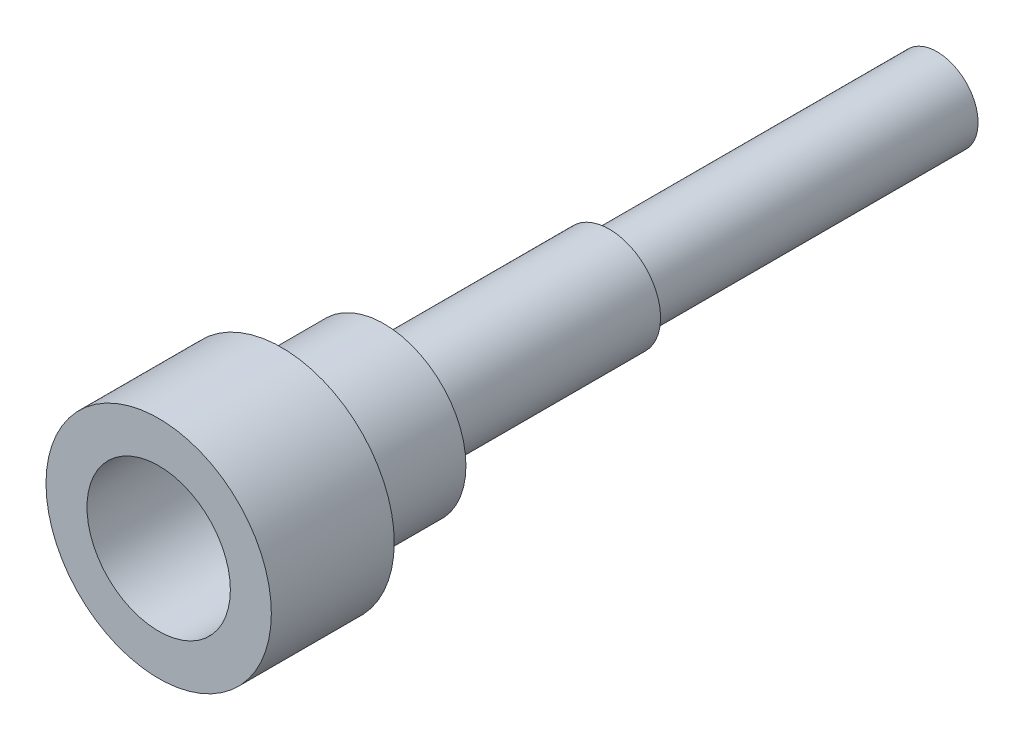
ISO-10303-21;
HEADER;
FILE_DESCRIPTION(('STEP AP214'),'2;1');
FILE_NAME('part.step','',(''),(''),'','','');
FILE_SCHEMA(('AUTOMOTIVE_DESIGN { 1 0 10303 214 1 1 1 1 }'));
ENDSEC;
DATA;
#1=APPLICATION_CONTEXT('core data for automotive mechanical design processes');
#2=APPLICATION_PROTOCOL_DEFINITION('international standard','automotive_design',2000,#1);
#3=PRODUCT_CONTEXT('',#1,'mechanical');
#4=PRODUCT('Part','Part','',(#3));
#5=PRODUCT_RELATED_PRODUCT_CATEGORY('part','',(#4));
#6=PRODUCT_DEFINITION_FORMATION('','',#4);
#7=PRODUCT_DEFINITION_CONTEXT('part definition',#1,'design');
#8=PRODUCT_DEFINITION('design','',#6,#7);
#9=PRODUCT_DEFINITION_SHAPE('','',#8);
#10=(LENGTH_UNIT() NAMED_UNIT(*) SI_UNIT(.MILLI.,.METRE.));
#11=(NAMED_UNIT(*) PLANE_ANGLE_UNIT() SI_UNIT($,.RADIAN.));
#12=(NAMED_UNIT(*) SI_UNIT($,.STERADIAN.) SOLID_ANGLE_UNIT());
#13=UNCERTAINTY_MEASURE_WITH_UNIT(LENGTH_MEASURE(1.E-05),#10,'distance_accuracy_value','');
#14=(GEOMETRIC_REPRESENTATION_CONTEXT(3) GLOBAL_UNCERTAINTY_ASSIGNED_CONTEXT((#13)) GLOBAL_UNIT_ASSIGNED_CONTEXT((#10,
#11,#12)) REPRESENTATION_CONTEXT('',''));
#15=CARTESIAN_POINT('',(0.,0.,0.));
#16=DIRECTION('',(0.,0.,1.));
#17=DIRECTION('',(1.,0.,0.));
#18=AXIS2_PLACEMENT_3D('',#15,#16,#17);
#19=CARTESIAN_POINT('',(0.,0.,5.));
#20=DIRECTION('',(0.,0.,-1.));
#21=DIRECTION('',(-1.,0.,0.));
#22=AXIS2_PLACEMENT_3D('',#19,#20,#21);
#23=CYLINDRICAL_SURFACE('',#22,4.);
#24=CARTESIAN_POINT('',(0.,0.,5.));
#25=DIRECTION('',(0.,0.,1.));
#26=DIRECTION('',(1.,0.,0.));
#27=AXIS2_PLACEMENT_3D('',#24,#25,#26);
#28=CIRCLE('',#27,4.);
#29=CARTESIAN_POINT('',(4.,0.,5.));
#30=VERTEX_POINT('',#29);
#31=EDGE_CURVE('E70',#30,#30,#28,.T.);
#32=ORIENTED_EDGE('',*,*,#31,.F.);
#33=EDGE_LOOP('',(#32));
#34=FACE_BOUND('',#33,.T.);
#35=CARTESIAN_POINT('',(0.,0.,0.));
#36=DIRECTION('',(0.,0.,1.));
#37=DIRECTION('',(1.,0.,0.));
#38=AXIS2_PLACEMENT_3D('',#35,#36,#37);
#39=CIRCLE('',#38,4.);
#40=CARTESIAN_POINT('',(4.,0.,0.));
#41=VERTEX_POINT('',#40);
#42=EDGE_CURVE('E67',#41,#41,#39,.T.);
#43=ORIENTED_EDGE('',*,*,#42,.T.);
#44=EDGE_LOOP('',(#43));
#45=FACE_BOUND('',#44,.T.);
#46=ADVANCED_FACE('F34',(#34,#45),#23,.T.);
#47=CARTESIAN_POINT('',(0.,0.,0.));
#48=DIRECTION('',(0.,0.,1.));
#49=DIRECTION('',(1.,0.,0.));
#50=AXIS2_PLACEMENT_3D('',#47,#48,#49);
#51=PLANE('',#50);
#52=CARTESIAN_POINT('',(0.,0.,0.));
#53=DIRECTION('',(0.,0.,-1.));
#54=DIRECTION('',(-1.,0.,0.));
#55=AXIS2_PLACEMENT_3D('',#52,#53,#54);
#56=CIRCLE('',#55,2.5);
#57=CARTESIAN_POINT('',(-2.5,0.,0.));
#58=VERTEX_POINT('',#57);
#59=EDGE_CURVE('E46',#58,#58,#56,.T.);
#60=ORIENTED_EDGE('',*,*,#59,.F.);
#61=EDGE_LOOP('',(#60));
#62=FACE_BOUND('',#61,.T.);
#63=ORIENTED_EDGE('',*,*,#42,.F.);
#64=EDGE_LOOP('',(#63));
#65=FACE_BOUND('',#64,.T.);
#66=ADVANCED_FACE('F94',(#62,#65),#51,.F.);
#67=CARTESIAN_POINT('',(0.,0.,11.));
#68=DIRECTION('',(0.,0.,1.));
#69=DIRECTION('',(1.,0.,0.));
#70=AXIS2_PLACEMENT_3D('',#67,#68,#69);
#71=PLANE('',#70);
#72=CARTESIAN_POINT('',(0.,0.,11.));
#73=DIRECTION('',(0.,0.,1.));
#74=DIRECTION('',(1.,0.,0.));
#75=AXIS2_PLACEMENT_3D('',#72,#73,#74);
#76=CIRCLE('',#75,5.5);
#77=CARTESIAN_POINT('',(5.5,0.,11.));
#78=VERTEX_POINT('',#77);
#79=EDGE_CURVE('E64',#78,#78,#76,.T.);
#80=ORIENTED_EDGE('',*,*,#79,.T.);
#81=EDGE_LOOP('',(#80));
#82=FACE_BOUND('',#81,.T.);
#83=CARTESIAN_POINT('',(0.,0.,11.));
#84=DIRECTION('',(0.,0.,1.));
#85=DIRECTION('',(1.,0.,0.));
#86=AXIS2_PLACEMENT_3D('',#83,#84,#85);
#87=CIRCLE('',#86,3.5);
#88=CARTESIAN_POINT('',(3.5,0.,11.));
#89=VERTEX_POINT('',#88);
#90=EDGE_CURVE('E59',#89,#89,#87,.T.);
#91=ORIENTED_EDGE('',*,*,#90,.F.);
#92=EDGE_LOOP('',(#91));
#93=FACE_BOUND('',#92,.T.);
#94=ADVANCED_FACE('F99',(#82,#93),#71,.T.);
#95=CARTESIAN_POINT('',(0.,0.,5.));
#96=DIRECTION('',(0.,0.,1.));
#97=DIRECTION('',(1.,0.,0.));
#98=AXIS2_PLACEMENT_3D('',#95,#96,#97);
#99=PLANE('',#98);
#100=ORIENTED_EDGE('',*,*,#31,.T.);
#101=EDGE_LOOP('',(#100));
#102=FACE_BOUND('',#101,.T.);
#103=CARTESIAN_POINT('',(0.,0.,5.));
#104=DIRECTION('',(0.,0.,1.));
#105=DIRECTION('',(1.,0.,0.));
#106=AXIS2_PLACEMENT_3D('',#103,#104,#105);
#107=CIRCLE('',#106,5.5);
#108=CARTESIAN_POINT('',(5.5,0.,5.));
#109=VERTEX_POINT('',#108);
#110=EDGE_CURVE('E63',#109,#109,#107,.T.);
#111=ORIENTED_EDGE('',*,*,#110,.F.);
#112=EDGE_LOOP('',(#111));
#113=FACE_BOUND('',#112,.T.);
#114=ADVANCED_FACE('F106',(#102,#113),#99,.F.);
#115=CARTESIAN_POINT('',(0.,0.,11.));
#116=DIRECTION('',(0.,0.,-1.));
#117=DIRECTION('',(-1.,0.,0.));
#118=AXIS2_PLACEMENT_3D('',#115,#116,#117);
#119=CYLINDRICAL_SURFACE('',#118,5.5);
#120=ORIENTED_EDGE('',*,*,#79,.F.);
#121=EDGE_LOOP('',(#120));
#122=FACE_BOUND('',#121,.T.);
#123=ORIENTED_EDGE('',*,*,#110,.T.);
#124=EDGE_LOOP('',(#123));
#125=FACE_BOUND('',#124,.T.);
#126=ADVANCED_FACE('F89',(#122,#125),#119,.T.);
#127=CARTESIAN_POINT('',(0.,0.,11.));
#128=DIRECTION('',(0.,0.,-1.));
#129=DIRECTION('',(-1.,0.,0.));
#130=AXIS2_PLACEMENT_3D('',#127,#128,#129);
#131=CYLINDRICAL_SURFACE('',#130,3.5);
#132=ORIENTED_EDGE('',*,*,#90,.T.);
#133=EDGE_LOOP('',(#132));
#134=FACE_BOUND('',#133,.T.);
#135=CARTESIAN_POINT('',(0.,0.,5.));
#136=DIRECTION('',(0.,0.,1.));
#137=DIRECTION('',(1.,0.,0.));
#138=AXIS2_PLACEMENT_3D('',#135,#136,#137);
#139=CIRCLE('',#138,3.5);
#140=CARTESIAN_POINT('',(3.5,0.,5.));
#141=VERTEX_POINT('',#140);
#142=EDGE_CURVE('E51',#141,#141,#139,.F.);
#143=ORIENTED_EDGE('',*,*,#142,.T.);
#144=EDGE_LOOP('',(#143));
#145=FACE_BOUND('',#144,.T.);
#146=ADVANCED_FACE('F77',(#134,#145),#131,.F.);
#147=CARTESIAN_POINT('',(0.,0.,5.));
#148=DIRECTION('',(0.,0.,1.));
#149=DIRECTION('',(1.,0.,0.));
#150=AXIS2_PLACEMENT_3D('',#147,#148,#149);
#151=PLANE('',#150);
#152=ORIENTED_EDGE('',*,*,#142,.F.);
#153=EDGE_LOOP('',(#152));
#154=FACE_BOUND('',#153,.T.);
#155=ADVANCED_FACE('F79',(#154),#151,.T.);
#156=CARTESIAN_POINT('',(0.,0.,-11.));
#157=DIRECTION('',(0.,0.,1.));
#158=DIRECTION('',(1.,0.,0.));
#159=AXIS2_PLACEMENT_3D('',#156,#157,#158);
#160=CYLINDRICAL_SURFACE('',#159,2.5);
#161=CARTESIAN_POINT('',(0.,-2.5,-8.75));
#162=CARTESIAN_POINT('',(0.0411443063766499,-2.49999964625275,-8.75000049874244));
#163=CARTESIAN_POINT('',(0.0822936591757647,-2.49897457846979,-8.75339693181198));
#164=CARTESIAN_POINT('',(0.16339406265244,-2.49498552796844,-8.76686067711105));
#165=CARTESIAN_POINT('',(0.203344752205709,-2.49202096694839,-8.77692997901167));
#166=CARTESIAN_POINT('',(0.280866353877263,-2.48447776250925,-8.80337300845513));
#167=CARTESIAN_POINT('',(0.318440682197688,-2.47990150125239,-8.81973743480948));
#168=CARTESIAN_POINT('',(0.390312090526564,-2.46961054618796,-8.85826804652791));
#169=CARTESIAN_POINT('',(0.424608733734829,-2.46389570095935,-8.88043500369767));
#170=CARTESIAN_POINT('',(0.489935898591877,-2.45175368596488,-8.93061200373637));
#171=CARTESIAN_POINT('',(0.520859035622189,-2.445311918289,-8.95875831294309));
#172=CARTESIAN_POINT('',(0.577624604616598,-2.43252917104839,-9.01980461495495));
#173=CARTESIAN_POINT('',(0.60346618163713,-2.42618820860824,-9.05270540606195));
#174=CARTESIAN_POINT('',(0.649900188618613,-2.41417056998345,-9.12323537651934));
#175=CARTESIAN_POINT('',(0.67036154511135,-2.4085120333744,-9.1609542304974));
#176=CARTESIAN_POINT('',(0.704606973873519,-2.39871810191514,-9.23949462711312));
#177=CARTESIAN_POINT('',(0.71839264959881,-2.39458234136111,-9.28031542195642));
#178=CARTESIAN_POINT('',(0.738508168412816,-2.38845435439231,-9.36269513306657));
#179=CARTESIAN_POINT('',(0.745035981175235,-2.38640534735888,-9.40420137194677));
#180=CARTESIAN_POINT('',(0.751068653075397,-2.38451394948142,-9.48776657812637));
#181=CARTESIAN_POINT('',(0.750575213805359,-2.38467102399598,-9.52982540903726));
#182=CARTESIAN_POINT('',(0.742734885998503,-2.38712372015292,-9.61169195430293));
#183=CARTESIAN_POINT('',(0.735636026313278,-2.38934194294585,-9.65152612518077));
#184=CARTESIAN_POINT('',(0.715187102135429,-2.39554178119298,-9.72940989313708));
#185=CARTESIAN_POINT('',(0.701836420708245,-2.3995235706752,-9.76745931368726));
#186=CARTESIAN_POINT('',(0.669080133268368,-2.40886366536123,-9.84130017483028));
#187=CARTESIAN_POINT('',(0.649594084673202,-2.4142400805761,-9.87705354197761));
#188=CARTESIAN_POINT('',(0.605176112943428,-2.42575493500398,-9.94486601100512));
#189=CARTESIAN_POINT('',(0.580242870012945,-2.43189355873595,-9.97692421470689));
#190=CARTESIAN_POINT('',(0.524406453827729,-2.44455505648865,-10.037843095381));
#191=CARTESIAN_POINT('',(0.493297453733486,-2.45108327155221,-10.0665143320148));
#192=CARTESIAN_POINT('',(0.426631629656985,-2.46356122031657,-10.1182769920321));
#193=CARTESIAN_POINT('',(0.391074525930445,-2.46951091759212,-10.1413680642072));
#194=CARTESIAN_POINT('',(0.316177519171402,-2.48021580034728,-10.1814299612324));
#195=CARTESIAN_POINT('',(0.276813874873976,-2.48496271834155,-10.1983587581249));
#196=CARTESIAN_POINT('',(0.19562270780176,-2.49266760916113,-10.2252997950498));
#197=CARTESIAN_POINT('',(0.153795875794791,-2.495626080935,-10.2353139642662));
#198=CARTESIAN_POINT('',(0.0704761213341659,-2.49934182321769,-10.2478260889497));
#199=CARTESIAN_POINT('',(0.0290250488005933,-2.50017425208896,-10.2505807929008));
#200=CARTESIAN_POINT('',(-0.0537498029116908,-2.49976461620879,-10.249215422144));
#201=CARTESIAN_POINT('',(-0.0950735983453885,-2.49852282838873,-10.2450962651743));
#202=CARTESIAN_POINT('',(-0.17545180265485,-2.49415348493587,-10.2303076944442));
#203=CARTESIAN_POINT('',(-0.21453638630709,-2.49106914899727,-10.2197883062095));
#204=CARTESIAN_POINT('',(-0.290377319477255,-2.48337173920747,-10.1926783836109));
#205=CARTESIAN_POINT('',(-0.327133388512772,-2.47875848160472,-10.1760871194811));
#206=CARTESIAN_POINT('',(-0.398218594730547,-2.46834827175735,-10.1368734172594));
#207=CARTESIAN_POINT('',(-0.432471913099914,-2.4625264041511,-10.1141203295258));
#208=CARTESIAN_POINT('',(-0.496761653989994,-2.45036734381886,-10.0633876229738));
#209=CARTESIAN_POINT('',(-0.526797016177672,-2.44403002214522,-10.0354066940569));
#210=CARTESIAN_POINT('',(-0.58292872275544,-2.43126585935624,-9.97380634581452));
#211=CARTESIAN_POINT('',(-0.608842406158678,-2.42484412520639,-9.94001906211106));
#212=CARTESIAN_POINT('',(-0.654644975359606,-2.41288257615227,-9.86843603049631));
#213=CARTESIAN_POINT('',(-0.67453401914302,-2.40734273812361,-9.83064038773239));
#214=CARTESIAN_POINT('',(-0.707586735638617,-2.39783594822466,-9.75223375436488));
#215=CARTESIAN_POINT('',(-0.720781734698861,-2.39386168977456,-9.71163690669671));
#216=CARTESIAN_POINT('',(-0.740108654089556,-2.38795797236724,-9.62865601549723));
#217=CARTESIAN_POINT('',(-0.746242994897492,-2.38602781268684,-9.58627258959433));
#218=CARTESIAN_POINT('',(-0.751109922422096,-2.38449986234108,-9.502819240819));
#219=CARTESIAN_POINT('',(-0.750140276541593,-2.38480823717645,-9.46176817449311));
#220=CARTESIAN_POINT('',(-0.741537527224925,-2.38749700647879,-9.3804429483117));
#221=CARTESIAN_POINT('',(-0.733904690623809,-2.3898773179727,-9.34016875741132));
#222=CARTESIAN_POINT('',(-0.712384444020456,-2.39637881834211,-9.26202730042908));
#223=CARTESIAN_POINT('',(-0.698575877535282,-2.40047802272719,-9.22413635631929));
#224=CARTESIAN_POINT('',(-0.665157535605707,-2.40995139454832,-9.151178780591));
#225=CARTESIAN_POINT('',(-0.645546649814398,-2.41532580597228,-9.11611269117959));
#226=CARTESIAN_POINT('',(-0.600243819025343,-2.42698838212842,-9.04841844173648));
#227=CARTESIAN_POINT('',(-0.574356380464964,-2.43330270081879,-9.0159256193698));
#228=CARTESIAN_POINT('',(-0.517587173148913,-2.44600660225033,-8.95564875084606));
#229=CARTESIAN_POINT('',(-0.486704108567251,-2.45239620411958,-8.92786593026612));
#230=CARTESIAN_POINT('',(-0.419732881091622,-2.46475468285319,-8.87698829385249));
#231=CARTESIAN_POINT('',(-0.383518942895303,-2.47070579882836,-8.85405427657225));
#232=CARTESIAN_POINT('',(-0.307570686991766,-2.48130340227908,-8.81463241504799));
#233=CARTESIAN_POINT('',(-0.267838026499478,-2.48595049965534,-8.79814155586275));
#234=CARTESIAN_POINT('',(-0.190378856327641,-2.4930108748465,-8.77355236217363));
#235=CARTESIAN_POINT('',(-0.152893480977117,-2.49561013690534,-8.76474416355838));
#236=CARTESIAN_POINT('',(-0.0769400976153898,-2.49910472247246,-8.75296823737921));
#237=CARTESIAN_POINT('',(-0.0384722549290699,-2.5000003307737,-8.74999953364759));
#238=CARTESIAN_POINT('',(0.,-2.5,-8.75));
#239=B_SPLINE_CURVE_WITH_KNOTS('',3,(#161,#162,#163,#164,#165,#166,#167,#168,#169,#170,#171,
#172,#173,#174,#175,#176,#177,#178,#179,#180,#181,#182,#183,#184,#185,#186,#187,#188,#189,#190,
#191,#192,#193,#194,#195,#196,#197,#198,#199,#200,#201,#202,#203,#204,#205,#206,#207,#208,#209,
#210,#211,#212,#213,#214,#215,#216,#217,#218,#219,#220,#221,#222,#223,#224,#225,#226,#227,#228,
#229,#230,#231,#232,#233,#234,#235,#236,#237,#238),.UNSPECIFIED.,.T.,.F.,(4,2,2,2,2,2,2,2,2,2,2,
2,2,2,2,2,2,2,2,2,2,2,2,2,2,2,2,2,2,2,2,2,2,2,2,2,2,2,4),(0.,0.123291601806305,0.246619982423,
0.369766838150437,0.49293008220635,0.619278014740956,0.745647186443164,0.874857405020546,
1.00403657271612,1.12959844676438,1.25512989155768,1.37613008345061,1.49714221825224,
1.61981213219783,1.74251180075501,1.87033552020307,1.99816728261759,2.12685523437067,
2.25550726760627,2.37954404715496,2.50356426771387,2.62478373337387,2.74601777293087,
2.87005652847677,2.99412640996319,3.12270200157632,3.25127422122563,3.37923907470651,
3.50716004723841,3.6297507772717,3.75233659824499,3.8734002019506,3.99448698770253,
4.11998462833665,4.2455148744245,4.37471498072035,4.50385455791317,4.61915845958929,
4.73444308468136),.UNSPECIFIED.);
#240=CARTESIAN_POINT('',(0.,-2.5,-8.75));
#241=VERTEX_POINT('',#240);
#242=EDGE_CURVE('E37',#241,#241,#239,.T.);
#243=ORIENTED_EDGE('',*,*,#242,.T.);
#244=EDGE_LOOP('',(#243));
#245=FACE_BOUND('',#244,.T.);
#246=CARTESIAN_POINT('',(0.,0.,-11.));
#247=DIRECTION('',(0.,0.,-1.));
#248=DIRECTION('',(-1.,0.,0.));
#249=AXIS2_PLACEMENT_3D('',#246,#247,#248);
#250=CIRCLE('',#249,2.5);
#251=CARTESIAN_POINT('',(-2.5,0.,-11.));
#252=VERTEX_POINT('',#251);
#253=EDGE_CURVE('E57',#252,#252,#250,.T.);
#254=ORIENTED_EDGE('',*,*,#253,.F.);
#255=EDGE_LOOP('',(#254));
#256=FACE_BOUND('',#255,.T.);
#257=ORIENTED_EDGE('',*,*,#59,.T.);
#258=EDGE_LOOP('',(#257));
#259=FACE_BOUND('',#258,.T.);
#260=ADVANCED_FACE('F81',(#245,#256,#259),#160,.T.);
#261=CARTESIAN_POINT('',(0.,0.,-11.));
#262=DIRECTION('',(0.,0.,-1.));
#263=DIRECTION('',(-1.,0.,0.));
#264=AXIS2_PLACEMENT_3D('',#261,#262,#263);
#265=PLANE('',#264);
#266=CARTESIAN_POINT('',(0.,0.,-11.));
#267=DIRECTION('',(0.,0.,-1.));
#268=DIRECTION('',(-1.,0.,0.));
#269=AXIS2_PLACEMENT_3D('',#266,#267,#268);
#270=CIRCLE('',#269,2.);
#271=CARTESIAN_POINT('',(-2.,0.,-11.));
#272=VERTEX_POINT('',#271);
#273=EDGE_CURVE('E10',#272,#272,#270,.T.);
#274=ORIENTED_EDGE('',*,*,#273,.F.);
#275=EDGE_LOOP('',(#274));
#276=FACE_BOUND('',#275,.T.);
#277=ORIENTED_EDGE('',*,*,#253,.T.);
#278=EDGE_LOOP('',(#277));
#279=FACE_BOUND('',#278,.T.);
#280=ADVANCED_FACE('F87',(#276,#279),#265,.T.);
#281=CARTESIAN_POINT('',(0.,0.,-27.));
#282=DIRECTION('',(0.,0.,1.));
#283=DIRECTION('',(1.,0.,0.));
#284=AXIS2_PLACEMENT_3D('',#281,#282,#283);
#285=CYLINDRICAL_SURFACE('',#284,2.);
#286=CARTESIAN_POINT('',(0.,0.,-27.));
#287=DIRECTION('',(0.,0.,-1.));
#288=DIRECTION('',(-1.,0.,0.));
#289=AXIS2_PLACEMENT_3D('',#286,#287,#288);
#290=CIRCLE('',#289,2.);
#291=CARTESIAN_POINT('',(-2.,0.,-27.));
#292=VERTEX_POINT('',#291);
#293=EDGE_CURVE('E55',#292,#292,#290,.T.);
#294=ORIENTED_EDGE('',*,*,#293,.F.);
#295=EDGE_LOOP('',(#294));
#296=FACE_BOUND('',#295,.T.);
#297=ORIENTED_EDGE('',*,*,#273,.T.);
#298=EDGE_LOOP('',(#297));
#299=FACE_BOUND('',#298,.T.);
#300=ADVANCED_FACE('F124',(#296,#299),#285,.T.);
#301=CARTESIAN_POINT('',(0.,0.,-27.));
#302=DIRECTION('',(0.,0.,-1.));
#303=DIRECTION('',(-1.,0.,0.));
#304=AXIS2_PLACEMENT_3D('',#301,#302,#303);
#305=PLANE('',#304);
#306=ORIENTED_EDGE('',*,*,#293,.T.);
#307=EDGE_LOOP('',(#306));
#308=FACE_BOUND('',#307,.T.);
#309=ADVANCED_FACE('F128',(#308),#305,.T.);
#310=CARTESIAN_POINT('',(0.,-5.5,-9.5));
#311=DIRECTION('',(0.,1.,0.));
#312=DIRECTION('',(0.,0.,1.));
#313=AXIS2_PLACEMENT_3D('',#310,#311,#312);
#314=CYLINDRICAL_SURFACE('',#313,0.75);
#315=CARTESIAN_POINT('',(0.,0.,-9.5));
#316=DIRECTION('',(0.,1.,0.));
#317=DIRECTION('',(0.,0.,1.));
#318=AXIS2_PLACEMENT_3D('',#315,#316,#317);
#319=CIRCLE('',#318,0.75);
#320=CARTESIAN_POINT('',(0.,0.,-8.75));
#321=VERTEX_POINT('',#320);
#322=EDGE_CURVE('E144',#321,#321,#319,.T.);
#323=ORIENTED_EDGE('',*,*,#322,.T.);
#324=EDGE_LOOP('',(#323));
#325=FACE_BOUND('',#324,.T.);
#326=ORIENTED_EDGE('',*,*,#242,.F.);
#327=EDGE_LOOP('',(#326));
#328=FACE_BOUND('',#327,.T.);
#329=ADVANCED_FACE('F131',(#325,#328),#314,.F.);
#330=CARTESIAN_POINT('',(0.,0.,-9.5));
#331=DIRECTION('',(0.,1.,0.));
#332=DIRECTION('',(0.,0.,1.));
#333=AXIS2_PLACEMENT_3D('',#330,#331,#332);
#334=PLANE('',#333);
#335=ORIENTED_EDGE('',*,*,#322,.F.);
#336=EDGE_LOOP('',(#335));
#337=FACE_BOUND('',#336,.T.);
#338=ADVANCED_FACE('F136',(#337),#334,.F.);
#339=CLOSED_SHELL('',(#46,#66,#94,#114,#126,#146,#155,#260,#280,#300,#309,#329,#338));
#340=MANIFOLD_SOLID_BREP('B2',#339);
#341=ADVANCED_BREP_SHAPE_REPRESENTATION('',(#18,#340),#14);
#342=SHAPE_DEFINITION_REPRESENTATION(#9,#341);
ENDSEC;
END-ISO-10303-21;
